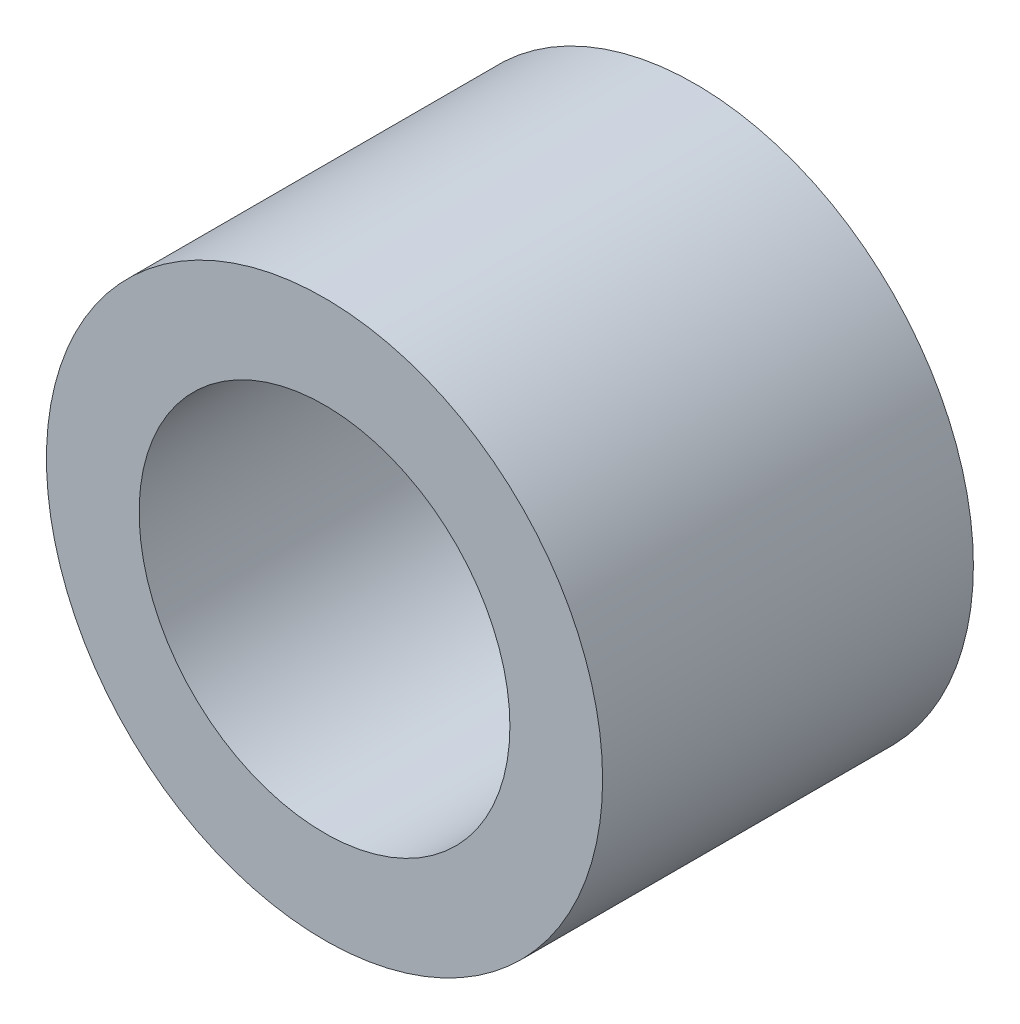
ISO-10303-21;
HEADER;
FILE_DESCRIPTION(('STEP AP214'),'2;1');
FILE_NAME('part.step','',(''),(''),'','','');
FILE_SCHEMA(('AUTOMOTIVE_DESIGN { 1 0 10303 214 1 1 1 1 }'));
ENDSEC;
DATA;
#1=APPLICATION_CONTEXT('core data for automotive mechanical design processes');
#2=APPLICATION_PROTOCOL_DEFINITION('international standard','automotive_design',2000,#1);
#3=PRODUCT_CONTEXT('',#1,'mechanical');
#4=PRODUCT('Part','Part','',(#3));
#5=PRODUCT_RELATED_PRODUCT_CATEGORY('part','',(#4));
#6=PRODUCT_DEFINITION_FORMATION('','',#4);
#7=PRODUCT_DEFINITION_CONTEXT('part definition',#1,'design');
#8=PRODUCT_DEFINITION('design','',#6,#7);
#9=PRODUCT_DEFINITION_SHAPE('','',#8);
#10=(LENGTH_UNIT() NAMED_UNIT(*) SI_UNIT(.MILLI.,.METRE.));
#11=(NAMED_UNIT(*) PLANE_ANGLE_UNIT() SI_UNIT($,.RADIAN.));
#12=(NAMED_UNIT(*) SI_UNIT($,.STERADIAN.) SOLID_ANGLE_UNIT());
#13=UNCERTAINTY_MEASURE_WITH_UNIT(LENGTH_MEASURE(1.E-05),#10,'distance_accuracy_value','');
#14=(GEOMETRIC_REPRESENTATION_CONTEXT(3) GLOBAL_UNCERTAINTY_ASSIGNED_CONTEXT((#13)) GLOBAL_UNIT_ASSIGNED_CONTEXT((#10,
#11,#12)) REPRESENTATION_CONTEXT('',''));
#15=CARTESIAN_POINT('',(0.,0.,0.));
#16=DIRECTION('',(0.,0.,1.));
#17=DIRECTION('',(1.,0.,0.));
#18=AXIS2_PLACEMENT_3D('',#15,#16,#17);
#19=CARTESIAN_POINT('',(0.,0.,4.));
#20=DIRECTION('',(0.,0.,1.));
#21=DIRECTION('',(1.,0.,0.));
#22=AXIS2_PLACEMENT_3D('',#19,#20,#21);
#23=PLANE('',#22);
#24=CARTESIAN_POINT('',(0.,0.,4.));
#25=DIRECTION('',(0.,0.,1.));
#26=DIRECTION('',(1.,0.,0.));
#27=AXIS2_PLACEMENT_3D('',#24,#25,#26);
#28=CIRCLE('',#27,3.);
#29=CARTESIAN_POINT('',(3.,0.,4.));
#30=VERTEX_POINT('',#29);
#31=EDGE_CURVE('E10',#30,#30,#28,.T.);
#32=ORIENTED_EDGE('',*,*,#31,.T.);
#33=EDGE_LOOP('',(#32));
#34=FACE_BOUND('',#33,.T.);
#35=CARTESIAN_POINT('',(0.,0.,4.));
#36=DIRECTION('',(0.,0.,1.));
#37=DIRECTION('',(1.,0.,0.));
#38=AXIS2_PLACEMENT_3D('',#35,#36,#37);
#39=CIRCLE('',#38,2.);
#40=CARTESIAN_POINT('',(2.,0.,4.));
#41=VERTEX_POINT('',#40);
#42=EDGE_CURVE('E42',#41,#41,#39,.T.);
#43=ORIENTED_EDGE('',*,*,#42,.F.);
#44=EDGE_LOOP('',(#43));
#45=FACE_BOUND('',#44,.T.);
#46=ADVANCED_FACE('F31',(#34,#45),#23,.T.);
#47=CARTESIAN_POINT('',(0.,0.,0.));
#48=DIRECTION('',(0.,0.,1.));
#49=DIRECTION('',(1.,0.,0.));
#50=AXIS2_PLACEMENT_3D('',#47,#48,#49);
#51=PLANE('',#50);
#52=CARTESIAN_POINT('',(0.,0.,0.));
#53=DIRECTION('',(0.,0.,1.));
#54=DIRECTION('',(1.,0.,0.));
#55=AXIS2_PLACEMENT_3D('',#52,#53,#54);
#56=CIRCLE('',#55,3.);
#57=CARTESIAN_POINT('',(3.,0.,0.));
#58=VERTEX_POINT('',#57);
#59=EDGE_CURVE('E35',#58,#58,#56,.T.);
#60=ORIENTED_EDGE('',*,*,#59,.F.);
#61=EDGE_LOOP('',(#60));
#62=FACE_BOUND('',#61,.T.);
#63=CARTESIAN_POINT('',(0.,0.,0.));
#64=DIRECTION('',(0.,0.,1.));
#65=DIRECTION('',(1.,0.,0.));
#66=AXIS2_PLACEMENT_3D('',#63,#64,#65);
#67=CIRCLE('',#66,2.);
#68=CARTESIAN_POINT('',(2.,0.,0.));
#69=VERTEX_POINT('',#68);
#70=EDGE_CURVE('E44',#69,#69,#67,.T.);
#71=ORIENTED_EDGE('',*,*,#70,.T.);
#72=EDGE_LOOP('',(#71));
#73=FACE_BOUND('',#72,.T.);
#74=ADVANCED_FACE('F54',(#62,#73),#51,.F.);
#75=CARTESIAN_POINT('',(0.,0.,4.));
#76=DIRECTION('',(0.,0.,-1.));
#77=DIRECTION('',(-1.,0.,0.));
#78=AXIS2_PLACEMENT_3D('',#75,#76,#77);
#79=CYLINDRICAL_SURFACE('',#78,3.);
#80=ORIENTED_EDGE('',*,*,#31,.F.);
#81=EDGE_LOOP('',(#80));
#82=FACE_BOUND('',#81,.T.);
#83=ORIENTED_EDGE('',*,*,#59,.T.);
#84=EDGE_LOOP('',(#83));
#85=FACE_BOUND('',#84,.T.);
#86=ADVANCED_FACE('F33',(#82,#85),#79,.T.);
#87=CARTESIAN_POINT('',(0.,0.,4.));
#88=DIRECTION('',(0.,0.,-1.));
#89=DIRECTION('',(-1.,0.,0.));
#90=AXIS2_PLACEMENT_3D('',#87,#88,#89);
#91=CYLINDRICAL_SURFACE('',#90,2.);
#92=ORIENTED_EDGE('',*,*,#42,.T.);
#93=EDGE_LOOP('',(#92));
#94=FACE_BOUND('',#93,.T.);
#95=ORIENTED_EDGE('',*,*,#70,.F.);
#96=EDGE_LOOP('',(#95));
#97=FACE_BOUND('',#96,.T.);
#98=ADVANCED_FACE('F50',(#94,#97),#91,.F.);
#99=CLOSED_SHELL('',(#46,#74,#86,#98));
#100=MANIFOLD_SOLID_BREP('B2',#99);
#101=ADVANCED_BREP_SHAPE_REPRESENTATION('',(#18,#100),#14);
#102=SHAPE_DEFINITION_REPRESENTATION(#9,#101);
ENDSEC;
END-ISO-10303-21;
